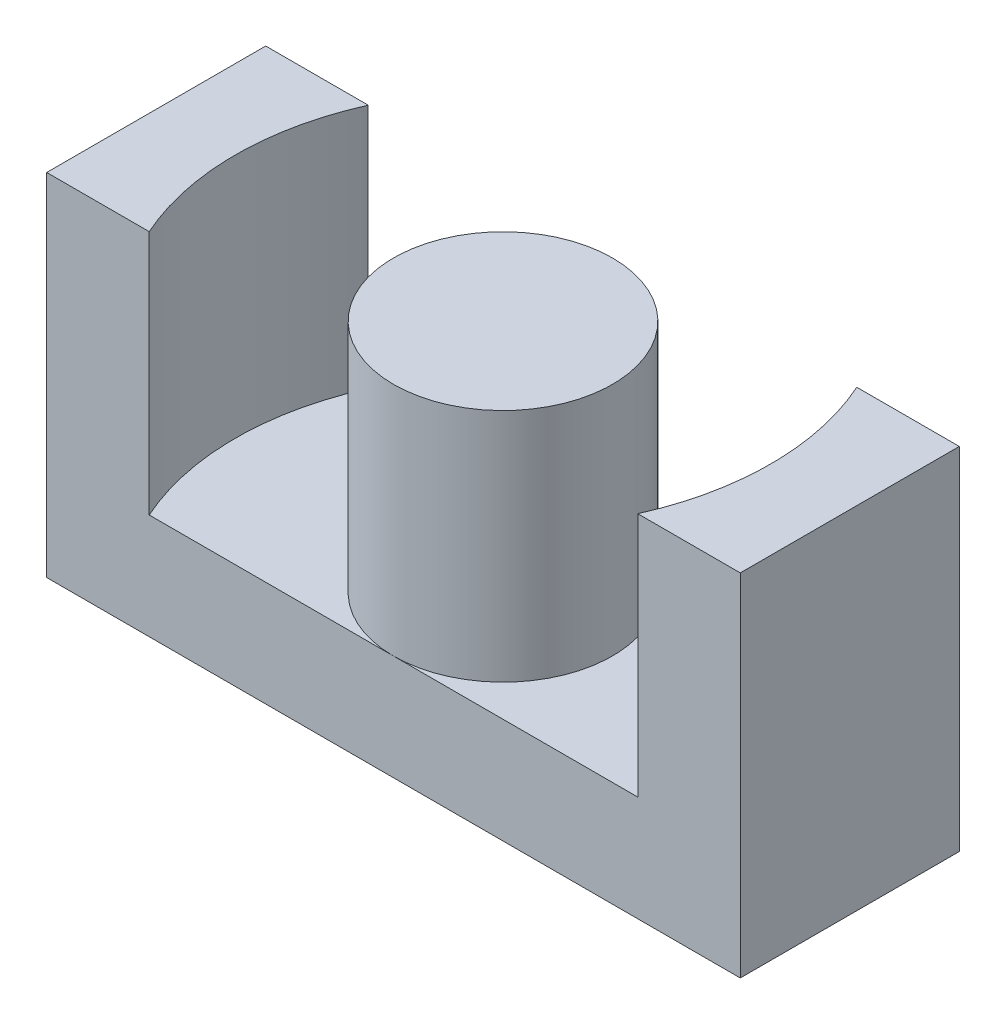
ISO-10303-21;
HEADER;
FILE_DESCRIPTION(('STEP AP214'),'2;1');
FILE_NAME('part.step','',(''),(''),'','','');
FILE_SCHEMA(('AUTOMOTIVE_DESIGN { 1 0 10303 214 1 1 1 1 }'));
ENDSEC;
DATA;
#1=APPLICATION_CONTEXT('core data for automotive mechanical design processes');
#2=APPLICATION_PROTOCOL_DEFINITION('international standard','automotive_design',2000,#1);
#3=PRODUCT_CONTEXT('',#1,'mechanical');
#4=PRODUCT('Part','Part','',(#3));
#5=PRODUCT_RELATED_PRODUCT_CATEGORY('part','',(#4));
#6=PRODUCT_DEFINITION_FORMATION('','',#4);
#7=PRODUCT_DEFINITION_CONTEXT('part definition',#1,'design');
#8=PRODUCT_DEFINITION('design','',#6,#7);
#9=PRODUCT_DEFINITION_SHAPE('','',#8);
#10=(LENGTH_UNIT() NAMED_UNIT(*) SI_UNIT(.MILLI.,.METRE.));
#11=(NAMED_UNIT(*) PLANE_ANGLE_UNIT() SI_UNIT($,.RADIAN.));
#12=(NAMED_UNIT(*) SI_UNIT($,.STERADIAN.) SOLID_ANGLE_UNIT());
#13=UNCERTAINTY_MEASURE_WITH_UNIT(LENGTH_MEASURE(1.E-05),#10,'distance_accuracy_value','');
#14=(GEOMETRIC_REPRESENTATION_CONTEXT(3) GLOBAL_UNCERTAINTY_ASSIGNED_CONTEXT((#13)) GLOBAL_UNIT_ASSIGNED_CONTEXT((#10,
#11,#12)) REPRESENTATION_CONTEXT('',''));
#15=CARTESIAN_POINT('',(0.,0.,0.));
#16=DIRECTION('',(0.,0.,1.));
#17=DIRECTION('',(1.,0.,0.));
#18=AXIS2_PLACEMENT_3D('',#15,#16,#17);
#19=CARTESIAN_POINT('',(-5.4648,16.8,-5.4648));
#20=DIRECTION('',(0.,1.,0.));
#21=DIRECTION('',(0.,0.,1.));
#22=AXIS2_PLACEMENT_3D('',#19,#20,#21);
#23=PLANE('',#22);
#24=CARTESIAN_POINT('',(0.,16.8,0.));
#25=DIRECTION('',(0.,-1.,0.));
#26=DIRECTION('',(0.,0.,-1.));
#27=AXIS2_PLACEMENT_3D('',#24,#25,#26);
#28=CIRCLE('',#27,5.4);
#29=CARTESIAN_POINT('',(0.,16.8,-5.4));
#30=VERTEX_POINT('',#29);
#31=EDGE_CURVE('E20',#30,#30,#28,.T.);
#32=ORIENTED_EDGE('',*,*,#31,.F.);
#33=EDGE_LOOP('',(#32));
#34=FACE_BOUND('',#33,.T.);
#35=ADVANCED_FACE('F17',(#34),#23,.T.);
#36=CARTESIAN_POINT('',(0.,16.8,0.));
#37=DIRECTION('',(0.,-1.,0.));
#38=DIRECTION('',(0.,0.,-1.));
#39=AXIS2_PLACEMENT_3D('',#36,#37,#38);
#40=CYLINDRICAL_SURFACE('',#39,5.4);
#41=CARTESIAN_POINT('',(0.,5.2,0.));
#42=DIRECTION('',(0.,-1.,0.));
#43=DIRECTION('',(0.,0.,-1.));
#44=AXIS2_PLACEMENT_3D('',#41,#42,#43);
#45=CIRCLE('',#44,5.4);
#46=CARTESIAN_POINT('',(2.69067754188335E-10,5.2,5.4));
#47=VERTEX_POINT('',#46);
#48=CARTESIAN_POINT('',(-8.34703833829664E-10,5.2,-5.4));
#49=VERTEX_POINT('',#48);
#50=EDGE_CURVE('E131',#47,#49,#45,.T.);
#51=ORIENTED_EDGE('',*,*,#50,.F.);
#52=CARTESIAN_POINT('',(0.,5.2,0.));
#53=DIRECTION('',(0.,-1.,0.));
#54=DIRECTION('',(0.,0.,-1.));
#55=AXIS2_PLACEMENT_3D('',#52,#53,#54);
#56=CIRCLE('',#55,5.4);
#57=EDGE_CURVE('E128',#49,#47,#56,.T.);
#58=ORIENTED_EDGE('',*,*,#57,.F.);
#59=EDGE_LOOP('',(#51,#58));
#60=FACE_BOUND('',#59,.T.);
#61=ORIENTED_EDGE('',*,*,#31,.T.);
#62=EDGE_LOOP('',(#61));
#63=FACE_BOUND('',#62,.T.);
#64=ADVANCED_FACE('F202',(#60,#63),#40,.T.);
#65=CARTESIAN_POINT('',(12.014585435,17.3,-5.400000002));
#66=DIRECTION('',(0.,1.,0.));
#67=DIRECTION('',(0.,0.,1.));
#68=AXIS2_PLACEMENT_3D('',#65,#66,#67);
#69=PLANE('',#68);
#70=CARTESIAN_POINT('',(-4.E-09,17.3,7.00000040571E-09));
#71=DIRECTION('',(0.,1.,0.));
#72=DIRECTION('',(0.,0.,1.));
#73=AXIS2_PLACEMENT_3D('',#70,#71,#72);
#74=CIRCLE('',#73,13.200000007);
#75=CARTESIAN_POINT('',(12.0449159440979,17.3,-5.4));
#76=VERTEX_POINT('',#75);
#77=CARTESIAN_POINT('',(12.0449159440717,17.3,5.4));
#78=VERTEX_POINT('',#77);
#79=EDGE_CURVE('E126',#76,#78,#74,.F.);
#80=ORIENTED_EDGE('',*,*,#79,.T.);
#81=DIRECTION('',(-1.,0.,0.));
#82=VECTOR('',#81,1.);
#83=CARTESIAN_POINT('',(17.1,17.3,5.4));
#84=LINE('',#83,#82);
#85=CARTESIAN_POINT('',(17.1,17.3,5.4));
#86=VERTEX_POINT('',#85);
#87=EDGE_CURVE('E173',#78,#86,#84,.F.);
#88=ORIENTED_EDGE('',*,*,#87,.T.);
#89=DIRECTION('',(0.,0.,1.));
#90=VECTOR('',#89,1.);
#91=CARTESIAN_POINT('',(17.1,17.3,-5.4));
#92=LINE('',#91,#90);
#93=CARTESIAN_POINT('',(17.1,17.3,-5.4));
#94=VERTEX_POINT('',#93);
#95=EDGE_CURVE('E178',#86,#94,#92,.F.);
#96=ORIENTED_EDGE('',*,*,#95,.T.);
#97=DIRECTION('',(1.,0.,0.));
#98=VECTOR('',#97,1.);
#99=CARTESIAN_POINT('',(-17.1,17.3,-5.4));
#100=LINE('',#99,#98);
#101=EDGE_CURVE('E111',#94,#76,#100,.F.);
#102=ORIENTED_EDGE('',*,*,#101,.T.);
#103=EDGE_LOOP('',(#80,#88,#96,#102));
#104=FACE_BOUND('',#103,.T.);
#105=ADVANCED_FACE('F205',(#104),#69,.T.);
#106=CARTESIAN_POINT('',(-17.1,17.3,-5.400000002));
#107=DIRECTION('',(0.,1.,0.));
#108=DIRECTION('',(0.,0.,1.));
#109=AXIS2_PLACEMENT_3D('',#106,#107,#108);
#110=PLANE('',#109);
#111=CARTESIAN_POINT('',(-4.E-09,17.3,7.00000040571E-09));
#112=DIRECTION('',(0.,1.,0.));
#113=DIRECTION('',(0.,0.,1.));
#114=AXIS2_PLACEMENT_3D('',#111,#112,#113);
#115=CIRCLE('',#114,13.200000007);
#116=CARTESIAN_POINT('',(-12.0449159548052,17.3,5.4));
#117=VERTEX_POINT('',#116);
#118=CARTESIAN_POINT('',(-12.0449159498719,17.3,-5.4));
#119=VERTEX_POINT('',#118);
#120=EDGE_CURVE('E85',#117,#119,#115,.F.);
#121=ORIENTED_EDGE('',*,*,#120,.T.);
#122=DIRECTION('',(1.,0.,0.));
#123=VECTOR('',#122,1.);
#124=CARTESIAN_POINT('',(-17.1,17.3,-5.4));
#125=LINE('',#124,#123);
#126=CARTESIAN_POINT('',(-17.1,17.3,-5.4));
#127=VERTEX_POINT('',#126);
#128=EDGE_CURVE('E89',#119,#127,#125,.F.);
#129=ORIENTED_EDGE('',*,*,#128,.T.);
#130=DIRECTION('',(0.,0.,-1.));
#131=VECTOR('',#130,1.);
#132=CARTESIAN_POINT('',(-17.1,17.3,5.4));
#133=LINE('',#132,#131);
#134=CARTESIAN_POINT('',(-17.1,17.3,5.4));
#135=VERTEX_POINT('',#134);
#136=EDGE_CURVE('E123',#127,#135,#133,.F.);
#137=ORIENTED_EDGE('',*,*,#136,.T.);
#138=DIRECTION('',(-1.,0.,0.));
#139=VECTOR('',#138,1.);
#140=CARTESIAN_POINT('',(17.1,17.3,5.4));
#141=LINE('',#140,#139);
#142=EDGE_CURVE('E92',#135,#117,#141,.F.);
#143=ORIENTED_EDGE('',*,*,#142,.T.);
#144=EDGE_LOOP('',(#121,#129,#137,#143));
#145=FACE_BOUND('',#144,.T.);
#146=ADVANCED_FACE('F87',(#145),#110,.T.);
#147=CARTESIAN_POINT('',(-4.E-09,5.2,7.00000040571E-09));
#148=DIRECTION('',(0.,1.,0.));
#149=DIRECTION('',(0.,0.,1.));
#150=AXIS2_PLACEMENT_3D('',#147,#148,#149);
#151=CYLINDRICAL_SURFACE('',#150,13.200000007);
#152=DIRECTION('',(0.,1.,0.));
#153=VECTOR('',#152,1.);
#154=CARTESIAN_POINT('',(-12.04491595128,0.,-5.4));
#155=LINE('',#154,#153);
#156=CARTESIAN_POINT('',(-12.0449159498719,5.2,-5.4));
#157=VERTEX_POINT('',#156);
#158=EDGE_CURVE('E97',#157,#119,#155,.T.);
#159=ORIENTED_EDGE('',*,*,#158,.T.);
#160=ORIENTED_EDGE('',*,*,#120,.F.);
#161=DIRECTION('',(0.,1.,0.));
#162=VECTOR('',#161,1.);
#163=CARTESIAN_POINT('',(-12.04491595487,0.,5.4));
#164=LINE('',#163,#162);
#165=CARTESIAN_POINT('',(-12.0449159548052,5.2,5.4));
#166=VERTEX_POINT('',#165);
#167=EDGE_CURVE('E142',#117,#166,#164,.F.);
#168=ORIENTED_EDGE('',*,*,#167,.T.);
#169=CARTESIAN_POINT('',(-4.E-09,5.2,7.00000040571E-09));
#170=DIRECTION('',(0.,1.,0.));
#171=DIRECTION('',(0.,0.,1.));
#172=AXIS2_PLACEMENT_3D('',#169,#170,#171);
#173=CIRCLE('',#172,13.200000007);
#174=EDGE_CURVE('E95',#157,#166,#173,.T.);
#175=ORIENTED_EDGE('',*,*,#174,.F.);
#176=EDGE_LOOP('',(#159,#160,#168,#175));
#177=FACE_BOUND('',#176,.T.);
#178=ADVANCED_FACE('F98',(#177),#151,.F.);
#179=CARTESIAN_POINT('',(-13.279200011,5.2,-5.400000002));
#180=DIRECTION('',(0.,1.,0.));
#181=DIRECTION('',(0.,0.,1.));
#182=AXIS2_PLACEMENT_3D('',#179,#180,#181);
#183=PLANE('',#182);
#184=ORIENTED_EDGE('',*,*,#50,.T.);
#185=DIRECTION('',(1.,0.,0.));
#186=VECTOR('',#185,1.);
#187=CARTESIAN_POINT('',(-17.1,5.2,-5.4));
#188=LINE('',#187,#186);
#189=EDGE_CURVE('E103',#49,#157,#188,.F.);
#190=ORIENTED_EDGE('',*,*,#189,.T.);
#191=ORIENTED_EDGE('',*,*,#174,.T.);
#192=DIRECTION('',(-1.,0.,0.));
#193=VECTOR('',#192,1.);
#194=CARTESIAN_POINT('',(17.1,5.2,5.4));
#195=LINE('',#194,#193);
#196=EDGE_CURVE('E138',#166,#47,#195,.F.);
#197=ORIENTED_EDGE('',*,*,#196,.T.);
#198=EDGE_LOOP('',(#184,#190,#191,#197));
#199=FACE_BOUND('',#198,.T.);
#200=ADVANCED_FACE('F137',(#199),#183,.T.);
#201=CARTESIAN_POINT('',(-0.0792,5.2,-5.400000002));
#202=DIRECTION('',(0.,1.,0.));
#203=DIRECTION('',(0.,0.,1.));
#204=AXIS2_PLACEMENT_3D('',#201,#202,#203);
#205=PLANE('',#204);
#206=ORIENTED_EDGE('',*,*,#57,.T.);
#207=DIRECTION('',(-1.,0.,0.));
#208=VECTOR('',#207,1.);
#209=CARTESIAN_POINT('',(17.1,5.2,5.4));
#210=LINE('',#209,#208);
#211=CARTESIAN_POINT('',(12.0449159440717,5.2,5.4));
#212=VERTEX_POINT('',#211);
#213=EDGE_CURVE('E144',#47,#212,#210,.F.);
#214=ORIENTED_EDGE('',*,*,#213,.T.);
#215=CARTESIAN_POINT('',(-4.E-09,5.2,7.00000040571E-09));
#216=DIRECTION('',(0.,1.,0.));
#217=DIRECTION('',(0.,0.,1.));
#218=AXIS2_PLACEMENT_3D('',#215,#216,#217);
#219=CIRCLE('',#218,13.200000007);
#220=CARTESIAN_POINT('',(12.0449159440979,5.2,-5.4));
#221=VERTEX_POINT('',#220);
#222=EDGE_CURVE('E124',#212,#221,#219,.T.);
#223=ORIENTED_EDGE('',*,*,#222,.T.);
#224=DIRECTION('',(1.,0.,0.));
#225=VECTOR('',#224,1.);
#226=CARTESIAN_POINT('',(-17.1,5.2,-5.4));
#227=LINE('',#226,#225);
#228=EDGE_CURVE('E120',#221,#49,#227,.F.);
#229=ORIENTED_EDGE('',*,*,#228,.T.);
#230=EDGE_LOOP('',(#206,#214,#223,#229));
#231=FACE_BOUND('',#230,.T.);
#232=ADVANCED_FACE('F199',(#231),#205,.T.);
#233=CARTESIAN_POINT('',(-4.E-09,5.2,7.00000040571E-09));
#234=DIRECTION('',(0.,1.,0.));
#235=DIRECTION('',(0.,0.,1.));
#236=AXIS2_PLACEMENT_3D('',#233,#234,#235);
#237=CYLINDRICAL_SURFACE('',#236,13.200000007);
#238=DIRECTION('',(0.,1.,0.));
#239=VECTOR('',#238,1.);
#240=CARTESIAN_POINT('',(12.044915941403,0.,5.4));
#241=LINE('',#240,#239);
#242=EDGE_CURVE('E146',#212,#78,#241,.T.);
#243=ORIENTED_EDGE('',*,*,#242,.T.);
#244=ORIENTED_EDGE('',*,*,#79,.F.);
#245=DIRECTION('',(0.,1.,0.));
#246=VECTOR('',#245,1.);
#247=CARTESIAN_POINT('',(12.044915947732,0.,-5.4));
#248=LINE('',#247,#246);
#249=EDGE_CURVE('E180',#76,#221,#248,.F.);
#250=ORIENTED_EDGE('',*,*,#249,.T.);
#251=ORIENTED_EDGE('',*,*,#222,.F.);
#252=EDGE_LOOP('',(#243,#244,#250,#251));
#253=FACE_BOUND('',#252,.T.);
#254=ADVANCED_FACE('F197',(#253),#237,.F.);
#255=CARTESIAN_POINT('',(-17.1,0.,5.4));
#256=DIRECTION('',(1.,0.,0.));
#257=DIRECTION('',(0.,0.,-1.));
#258=AXIS2_PLACEMENT_3D('',#255,#256,#257);
#259=PLANE('',#258);
#260=DIRECTION('',(0.,0.,-1.));
#261=VECTOR('',#260,1.);
#262=CARTESIAN_POINT('',(-17.1,0.,5.4));
#263=LINE('',#262,#261);
#264=CARTESIAN_POINT('',(-17.1,0.,5.4));
#265=VERTEX_POINT('',#264);
#266=CARTESIAN_POINT('',(-17.1,0.,-5.4));
#267=VERTEX_POINT('',#266);
#268=EDGE_CURVE('E154',#265,#267,#263,.T.);
#269=ORIENTED_EDGE('',*,*,#268,.F.);
#270=DIRECTION('',(0.,1.,0.));
#271=VECTOR('',#270,1.);
#272=CARTESIAN_POINT('',(-17.1,0.,5.4));
#273=LINE('',#272,#271);
#274=EDGE_CURVE('E157',#265,#135,#273,.T.);
#275=ORIENTED_EDGE('',*,*,#274,.T.);
#276=ORIENTED_EDGE('',*,*,#136,.F.);
#277=DIRECTION('',(0.,1.,0.));
#278=VECTOR('',#277,1.);
#279=CARTESIAN_POINT('',(-17.1,0.,-5.4));
#280=LINE('',#279,#278);
#281=EDGE_CURVE('E109',#127,#267,#280,.F.);
#282=ORIENTED_EDGE('',*,*,#281,.T.);
#283=EDGE_LOOP('',(#269,#275,#276,#282));
#284=FACE_BOUND('',#283,.T.);
#285=ADVANCED_FACE('F228',(#284),#259,.F.);
#286=CARTESIAN_POINT('',(-17.1,0.,-5.4));
#287=DIRECTION('',(0.,0.,1.));
#288=DIRECTION('',(1.,0.,0.));
#289=AXIS2_PLACEMENT_3D('',#286,#287,#288);
#290=PLANE('',#289);
#291=ORIENTED_EDGE('',*,*,#101,.F.);
#292=DIRECTION('',(0.,1.,0.));
#293=VECTOR('',#292,1.);
#294=CARTESIAN_POINT('',(17.1,0.,-5.4));
#295=LINE('',#294,#293);
#296=CARTESIAN_POINT('',(17.1,0.,-5.4));
#297=VERTEX_POINT('',#296);
#298=EDGE_CURVE('E175',#94,#297,#295,.F.);
#299=ORIENTED_EDGE('',*,*,#298,.T.);
#300=DIRECTION('',(1.,0.,0.));
#301=VECTOR('',#300,1.);
#302=CARTESIAN_POINT('',(-17.1,0.,-5.4));
#303=LINE('',#302,#301);
#304=EDGE_CURVE('E150',#267,#297,#303,.T.);
#305=ORIENTED_EDGE('',*,*,#304,.F.);
#306=ORIENTED_EDGE('',*,*,#281,.F.);
#307=ORIENTED_EDGE('',*,*,#128,.F.);
#308=ORIENTED_EDGE('',*,*,#158,.F.);
#309=ORIENTED_EDGE('',*,*,#189,.F.);
#310=ORIENTED_EDGE('',*,*,#228,.F.);
#311=ORIENTED_EDGE('',*,*,#249,.F.);
#312=EDGE_LOOP('',(#291,#299,#305,#306,#307,#308,#309,#310,#311));
#313=FACE_BOUND('',#312,.T.);
#314=ADVANCED_FACE('F107',(#313),#290,.F.);
#315=CARTESIAN_POINT('',(17.1,0.,-5.4));
#316=DIRECTION('',(-1.,0.,0.));
#317=DIRECTION('',(0.,0.,1.));
#318=AXIS2_PLACEMENT_3D('',#315,#316,#317);
#319=PLANE('',#318);
#320=DIRECTION('',(0.,0.,-1.));
#321=VECTOR('',#320,1.);
#322=CARTESIAN_POINT('',(17.1,0.,5.4));
#323=LINE('',#322,#321);
#324=CARTESIAN_POINT('',(17.1,0.,5.4));
#325=VERTEX_POINT('',#324);
#326=EDGE_CURVE('E26',#297,#325,#323,.F.);
#327=ORIENTED_EDGE('',*,*,#326,.F.);
#328=ORIENTED_EDGE('',*,*,#298,.F.);
#329=ORIENTED_EDGE('',*,*,#95,.F.);
#330=DIRECTION('',(0.,1.,0.));
#331=VECTOR('',#330,1.);
#332=CARTESIAN_POINT('',(17.1,0.,5.4));
#333=LINE('',#332,#331);
#334=EDGE_CURVE('E35',#86,#325,#333,.F.);
#335=ORIENTED_EDGE('',*,*,#334,.T.);
#336=EDGE_LOOP('',(#327,#328,#329,#335));
#337=FACE_BOUND('',#336,.T.);
#338=ADVANCED_FACE('F220',(#337),#319,.F.);
#339=CARTESIAN_POINT('',(17.1,0.,5.4));
#340=DIRECTION('',(0.,0.,-1.));
#341=DIRECTION('',(-1.,0.,0.));
#342=AXIS2_PLACEMENT_3D('',#339,#340,#341);
#343=PLANE('',#342);
#344=ORIENTED_EDGE('',*,*,#213,.F.);
#345=ORIENTED_EDGE('',*,*,#196,.F.);
#346=ORIENTED_EDGE('',*,*,#167,.F.);
#347=ORIENTED_EDGE('',*,*,#142,.F.);
#348=ORIENTED_EDGE('',*,*,#274,.F.);
#349=DIRECTION('',(1.,0.,0.));
#350=VECTOR('',#349,1.);
#351=CARTESIAN_POINT('',(-17.1,0.,5.4));
#352=LINE('',#351,#350);
#353=EDGE_CURVE('E11',#325,#265,#352,.F.);
#354=ORIENTED_EDGE('',*,*,#353,.F.);
#355=ORIENTED_EDGE('',*,*,#334,.F.);
#356=ORIENTED_EDGE('',*,*,#87,.F.);
#357=ORIENTED_EDGE('',*,*,#242,.F.);
#358=EDGE_LOOP('',(#344,#345,#346,#347,#348,#354,#355,#356,#357));
#359=FACE_BOUND('',#358,.T.);
#360=ADVANCED_FACE('F141',(#359),#343,.F.);
#361=CARTESIAN_POINT('',(-17.1,0.,5.4));
#362=DIRECTION('',(0.,-1.,0.));
#363=DIRECTION('',(0.,0.,-1.));
#364=AXIS2_PLACEMENT_3D('',#361,#362,#363);
#365=PLANE('',#364);
#366=ORIENTED_EDGE('',*,*,#326,.T.);
#367=ORIENTED_EDGE('',*,*,#353,.T.);
#368=ORIENTED_EDGE('',*,*,#268,.T.);
#369=ORIENTED_EDGE('',*,*,#304,.T.);
#370=EDGE_LOOP('',(#366,#367,#368,#369));
#371=FACE_BOUND('',#370,.T.);
#372=ADVANCED_FACE('F213',(#371),#365,.T.);
#373=CLOSED_SHELL('',(#35,#64,#105,#146,#178,#200,#232,#254,#285,#314,#338,#360,#372));
#374=MANIFOLD_SOLID_BREP('B1',#373);
#375=ADVANCED_BREP_SHAPE_REPRESENTATION('',(#18,#374),#14);
#376=SHAPE_DEFINITION_REPRESENTATION(#9,#375);
ENDSEC;
END-ISO-10303-21;
